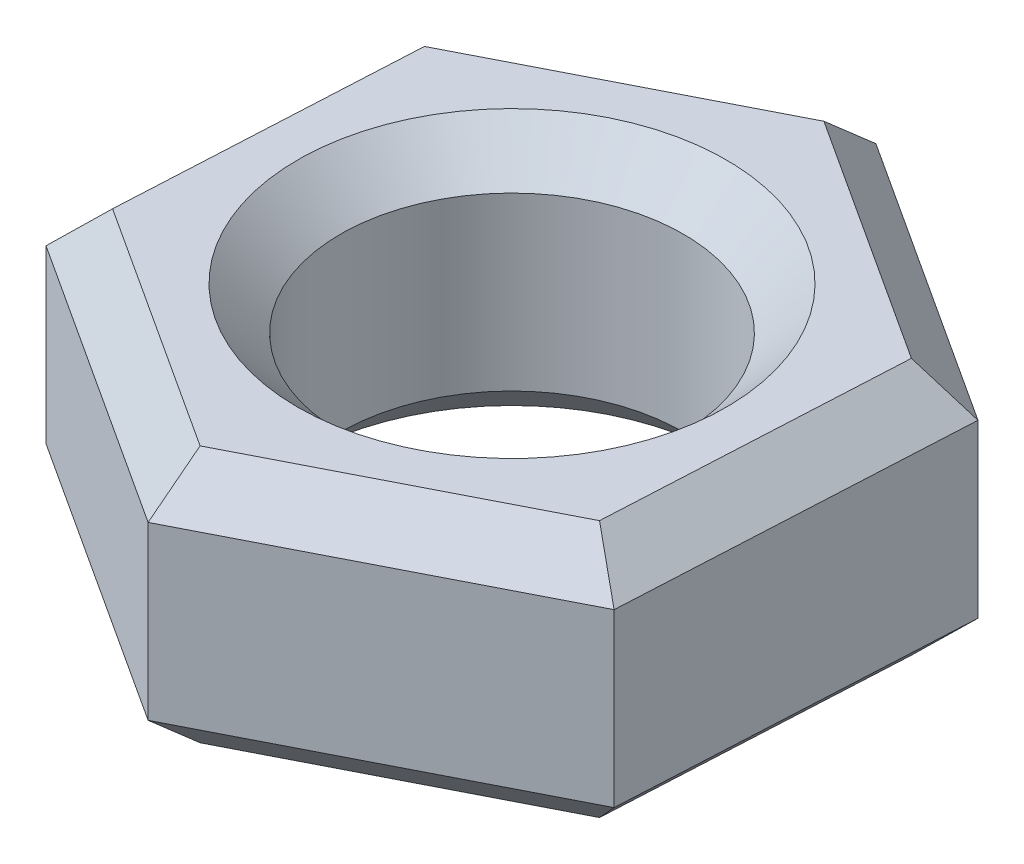
ISO-10303-21;
HEADER;
FILE_DESCRIPTION(('STEP AP214'),'2;1');
FILE_NAME('part.step','',(''),(''),'','','');
FILE_SCHEMA(('AUTOMOTIVE_DESIGN { 1 0 10303 214 1 1 1 1 }'));
ENDSEC;
DATA;
#1=APPLICATION_CONTEXT('core data for automotive mechanical design processes');
#2=APPLICATION_PROTOCOL_DEFINITION('international standard','automotive_design',2000,#1);
#3=PRODUCT_CONTEXT('',#1,'mechanical');
#4=PRODUCT('Part','Part','',(#3));
#5=PRODUCT_RELATED_PRODUCT_CATEGORY('part','',(#4));
#6=PRODUCT_DEFINITION_FORMATION('','',#4);
#7=PRODUCT_DEFINITION_CONTEXT('part definition',#1,'design');
#8=PRODUCT_DEFINITION('design','',#6,#7);
#9=PRODUCT_DEFINITION_SHAPE('','',#8);
#10=(LENGTH_UNIT() NAMED_UNIT(*) SI_UNIT(.MILLI.,.METRE.));
#11=(NAMED_UNIT(*) PLANE_ANGLE_UNIT() SI_UNIT($,.RADIAN.));
#12=(NAMED_UNIT(*) SI_UNIT($,.STERADIAN.) SOLID_ANGLE_UNIT());
#13=UNCERTAINTY_MEASURE_WITH_UNIT(LENGTH_MEASURE(1.E-05),#10,'distance_accuracy_value','');
#14=(GEOMETRIC_REPRESENTATION_CONTEXT(3) GLOBAL_UNCERTAINTY_ASSIGNED_CONTEXT((#13)) GLOBAL_UNIT_ASSIGNED_CONTEXT((#10,
#11,#12)) REPRESENTATION_CONTEXT('',''));
#15=CARTESIAN_POINT('',(0.,0.,0.));
#16=DIRECTION('',(0.,0.,1.));
#17=DIRECTION('',(1.,0.,0.));
#18=AXIS2_PLACEMENT_3D('',#15,#16,#17);
#19=CARTESIAN_POINT('',(0.,6.,0.));
#20=DIRECTION('',(0.,1.,0.));
#21=DIRECTION('',(0.,0.,1.));
#22=AXIS2_PLACEMENT_3D('',#19,#20,#21);
#23=PLANE('',#22);
#24=CARTESIAN_POINT('',(0.,6.,0.));
#25=DIRECTION('',(0.,1.,0.));
#26=DIRECTION('',(0.,0.,1.));
#27=AXIS2_PLACEMENT_3D('',#24,#25,#26);
#28=CIRCLE('',#27,5.);
#29=CARTESIAN_POINT('',(0.,6.,5.));
#30=VERTEX_POINT('',#29);
#31=EDGE_CURVE('E11',#30,#30,#28,.F.);
#32=ORIENTED_EDGE('',*,*,#31,.T.);
#33=EDGE_LOOP('',(#32));
#34=FACE_BOUND('',#33,.T.);
#35=DIRECTION('',(-0.0518026780154427,0.,0.998657339907152));
#36=VECTOR('',#35,1.);
#37=CARTESIAN_POINT('',(-6.20130207012162,6.,3.72520952007247));
#38=LINE('',#37,#36);
#39=CARTESIAN_POINT('',(-5.81249429886115,6.,-3.77026657223419));
#40=VERTEX_POINT('',#39);
#41=CARTESIAN_POINT('',(-6.17139378002466,6.,3.14863443604888));
#42=VERTEX_POINT('',#41);
#43=EDGE_CURVE('E50',#40,#42,#38,.T.);
#44=ORIENTED_EDGE('',*,*,#43,.T.);
#45=DIRECTION('',(0.838961287027663,0.,0.544191105099015));
#46=VECTOR('',#45,1.);
#47=CARTESIAN_POINT('',(0.125475043741586,6.,7.23308988930259));
#48=LINE('',#47,#46);
#49=CARTESIAN_POINT('',(-0.358899481163513,6.,6.91890100828307));
#50=VERTEX_POINT('',#49);
#51=EDGE_CURVE('E42',#42,#50,#48,.T.);
#52=ORIENTED_EDGE('',*,*,#51,.T.);
#53=DIRECTION('',(0.890763965043106,0.,-0.454466234808137));
#54=VECTOR('',#53,1.);
#55=CARTESIAN_POINT('',(6.32677711386321,6.,3.50788036923011));
#56=LINE('',#55,#54);
#57=CARTESIAN_POINT('',(5.81249429886115,6.,3.77026657223419));
#58=VERTEX_POINT('',#57);
#59=EDGE_CURVE('E189',#50,#58,#56,.T.);
#60=ORIENTED_EDGE('',*,*,#59,.T.);
#61=DIRECTION('',(0.0518026780154426,0.,-0.998657339907152));
#62=VECTOR('',#61,1.);
#63=CARTESIAN_POINT('',(6.20130207012162,6.,-3.72520952007247));
#64=LINE('',#63,#62);
#65=CARTESIAN_POINT('',(6.17139378002466,6.,-3.14863443604888));
#66=VERTEX_POINT('',#65);
#67=EDGE_CURVE('E191',#58,#66,#64,.T.);
#68=ORIENTED_EDGE('',*,*,#67,.T.);
#69=DIRECTION('',(-0.838961287027663,0.,-0.544191105099015));
#70=VECTOR('',#69,1.);
#71=CARTESIAN_POINT('',(-0.125475043741586,6.,-7.23308988930259));
#72=LINE('',#71,#70);
#73=CARTESIAN_POINT('',(0.358899481163513,6.,-6.91890100828307));
#74=VERTEX_POINT('',#73);
#75=EDGE_CURVE('E193',#66,#74,#72,.T.);
#76=ORIENTED_EDGE('',*,*,#75,.T.);
#77=DIRECTION('',(-0.890763965043106,0.,0.454466234808137));
#78=VECTOR('',#77,1.);
#79=CARTESIAN_POINT('',(-6.32677711386321,6.,-3.50788036923012));
#80=LINE('',#79,#78);
#81=EDGE_CURVE('E55',#74,#40,#80,.T.);
#82=ORIENTED_EDGE('',*,*,#81,.T.);
#83=EDGE_LOOP('',(#44,#52,#60,#68,#76,#82));
#84=FACE_BOUND('',#83,.T.);
#85=ADVANCED_FACE('F33',(#34,#84),#23,.T.);
#86=CARTESIAN_POINT('',(0.,0.,0.));
#87=DIRECTION('',(0.,1.,0.));
#88=DIRECTION('',(0.,0.,1.));
#89=AXIS2_PLACEMENT_3D('',#86,#87,#88);
#90=PLANE('',#89);
#91=CARTESIAN_POINT('',(0.,0.,0.));
#92=DIRECTION('',(0.,1.,0.));
#93=DIRECTION('',(0.,0.,1.));
#94=AXIS2_PLACEMENT_3D('',#91,#92,#93);
#95=CIRCLE('',#94,5.);
#96=CARTESIAN_POINT('',(0.,0.,5.));
#97=VERTEX_POINT('',#96);
#98=EDGE_CURVE('E151',#97,#97,#95,.T.);
#99=ORIENTED_EDGE('',*,*,#98,.T.);
#100=EDGE_LOOP('',(#99));
#101=FACE_BOUND('',#100,.T.);
#102=DIRECTION('',(0.838961287027663,0.,0.544191105099015));
#103=VECTOR('',#102,1.);
#104=CARTESIAN_POINT('',(3.26514663059409,0.,-5.03376772216598));
#105=LINE('',#104,#103);
#106=CARTESIAN_POINT('',(0.358899481163514,0.,-6.91890100828307));
#107=VERTEX_POINT('',#106);
#108=CARTESIAN_POINT('',(6.17139378002466,0.,-3.14863443604888));
#109=VERTEX_POINT('',#108);
#110=EDGE_CURVE('E150',#107,#109,#105,.T.);
#111=ORIENTED_EDGE('',*,*,#110,.T.);
#112=DIRECTION('',(-0.0518026780154426,0.,0.998657339907152));
#113=VECTOR('',#112,1.);
#114=CARTESIAN_POINT('',(5.99194403944291,0.,0.310816068092655));
#115=LINE('',#114,#113);
#116=CARTESIAN_POINT('',(5.81249429886115,0.,3.77026657223419));
#117=VERTEX_POINT('',#116);
#118=EDGE_CURVE('E129',#109,#117,#115,.T.);
#119=ORIENTED_EDGE('',*,*,#118,.T.);
#120=DIRECTION('',(-0.890763965043106,0.,0.454466234808137));
#121=VECTOR('',#120,1.);
#122=CARTESIAN_POINT('',(2.72679740884882,0.,5.34458379025863));
#123=LINE('',#122,#121);
#124=CARTESIAN_POINT('',(-0.358899481163513,0.,6.91890100828307));
#125=VERTEX_POINT('',#124);
#126=EDGE_CURVE('E139',#117,#125,#123,.T.);
#127=ORIENTED_EDGE('',*,*,#126,.T.);
#128=DIRECTION('',(-0.838961287027663,0.,-0.544191105099015));
#129=VECTOR('',#128,1.);
#130=CARTESIAN_POINT('',(-3.26514663059409,0.,5.03376772216597));
#131=LINE('',#130,#129);
#132=CARTESIAN_POINT('',(-6.17139378002466,0.,3.14863443604888));
#133=VERTEX_POINT('',#132);
#134=EDGE_CURVE('E145',#125,#133,#131,.T.);
#135=ORIENTED_EDGE('',*,*,#134,.T.);
#136=DIRECTION('',(0.0518026780154427,0.,-0.998657339907152));
#137=VECTOR('',#136,1.);
#138=CARTESIAN_POINT('',(-5.9919440394429,0.,-0.310816068092656));
#139=LINE('',#138,#137);
#140=CARTESIAN_POINT('',(-5.81249429886115,0.,-3.77026657223419));
#141=VERTEX_POINT('',#140);
#142=EDGE_CURVE('E251',#133,#141,#139,.T.);
#143=ORIENTED_EDGE('',*,*,#142,.T.);
#144=DIRECTION('',(0.890763965043106,0.,-0.454466234808137));
#145=VECTOR('',#144,1.);
#146=CARTESIAN_POINT('',(-2.72679740884882,0.,-5.34458379025863));
#147=LINE('',#146,#145);
#148=EDGE_CURVE('E156',#141,#107,#147,.T.);
#149=ORIENTED_EDGE('',*,*,#148,.T.);
#150=EDGE_LOOP('',(#111,#119,#127,#135,#143,#149));
#151=FACE_BOUND('',#150,.T.);
#152=ADVANCED_FACE('F148',(#101,#151),#90,.F.);
#153=CARTESIAN_POINT('',(-0.418716061357431,6.,8.07205117633025));
#154=DIRECTION('',(-0.454466234808137,0.,-0.890763965043106));
#155=DIRECTION('',(-0.890763965043106,0.,0.454466234808137));
#156=AXIS2_PLACEMENT_3D('',#153,#154,#155);
#157=PLANE('',#156);
#158=DIRECTION('',(0.,-1.,0.));
#159=VECTOR('',#158,1.);
#160=CARTESIAN_POINT('',(-0.418716061357431,6.,8.07205117633025));
#161=LINE('',#160,#159);
#162=CARTESIAN_POINT('',(-0.418716061357431,4.99999999999999,8.07205117633025));
#163=VERTEX_POINT('',#162);
#164=CARTESIAN_POINT('',(-0.418716061357431,1.,8.07205117633025));
#165=VERTEX_POINT('',#164);
#166=EDGE_CURVE('E208',#163,#165,#161,.T.);
#167=ORIENTED_EDGE('',*,*,#166,.T.);
#168=DIRECTION('',(0.890763965043106,0.,-0.454466234808137));
#169=VECTOR('',#168,1.);
#170=CARTESIAN_POINT('',(-0.418716061357431,1.,8.07205117633025));
#171=LINE('',#170,#169);
#172=CARTESIAN_POINT('',(6.78124334867135,1.,4.39864433427322));
#173=VERTEX_POINT('',#172);
#174=EDGE_CURVE('E187',#165,#173,#171,.T.);
#175=ORIENTED_EDGE('',*,*,#174,.T.);
#176=DIRECTION('',(0.,-1.,0.));
#177=VECTOR('',#176,1.);
#178=CARTESIAN_POINT('',(6.78124334867135,6.,4.39864433427322));
#179=LINE('',#178,#177);
#180=CARTESIAN_POINT('',(6.78124334867135,4.99999999999999,4.39864433427322));
#181=VERTEX_POINT('',#180);
#182=EDGE_CURVE('E146',#181,#173,#179,.T.);
#183=ORIENTED_EDGE('',*,*,#182,.F.);
#184=DIRECTION('',(-0.890763965043106,0.,0.454466234808137));
#185=VECTOR('',#184,1.);
#186=CARTESIAN_POINT('',(-0.418716061357431,4.99999999999999,8.07205117633025));
#187=LINE('',#186,#185);
#188=EDGE_CURVE('E185',#181,#163,#187,.T.);
#189=ORIENTED_EDGE('',*,*,#188,.T.);
#190=EDGE_LOOP('',(#167,#175,#183,#189));
#191=FACE_BOUND('',#190,.T.);
#192=ADVANCED_FACE('F275',(#191),#157,.F.);
#193=CARTESIAN_POINT('',(6.78124334867135,6.,4.39864433427322));
#194=DIRECTION('',(-0.998657339907152,0.,-0.0518026780154426));
#195=DIRECTION('',(-0.0518026780154426,0.,0.998657339907152));
#196=AXIS2_PLACEMENT_3D('',#193,#194,#195);
#197=PLANE('',#196);
#198=ORIENTED_EDGE('',*,*,#182,.T.);
#199=DIRECTION('',(0.0518026780154426,0.,-0.998657339907152));
#200=VECTOR('',#199,1.);
#201=CARTESIAN_POINT('',(6.78124334867135,1.,4.39864433427322));
#202=LINE('',#201,#200);
#203=CARTESIAN_POINT('',(7.19995941002878,1.,-3.67340684205703));
#204=VERTEX_POINT('',#203);
#205=EDGE_CURVE('E132',#173,#204,#202,.T.);
#206=ORIENTED_EDGE('',*,*,#205,.T.);
#207=DIRECTION('',(0.,-1.,0.));
#208=VECTOR('',#207,1.);
#209=CARTESIAN_POINT('',(7.19995941002878,6.,-3.67340684205703));
#210=LINE('',#209,#208);
#211=CARTESIAN_POINT('',(7.19995941002878,4.99999999999999,-3.67340684205703));
#212=VERTEX_POINT('',#211);
#213=EDGE_CURVE('E237',#212,#204,#210,.T.);
#214=ORIENTED_EDGE('',*,*,#213,.F.);
#215=DIRECTION('',(-0.0518026780154426,0.,0.998657339907152));
#216=VECTOR('',#215,1.);
#217=CARTESIAN_POINT('',(6.78124334867135,4.99999999999999,4.39864433427322));
#218=LINE('',#217,#216);
#219=EDGE_CURVE('E165',#212,#181,#218,.T.);
#220=ORIENTED_EDGE('',*,*,#219,.T.);
#221=EDGE_LOOP('',(#198,#206,#214,#220));
#222=FACE_BOUND('',#221,.T.);
#223=ADVANCED_FACE('F242',(#222),#197,.F.);
#224=CARTESIAN_POINT('',(7.19995941002878,6.,-3.67340684205703));
#225=DIRECTION('',(-0.544191105099015,0.,0.838961287027663));
#226=DIRECTION('',(0.838961287027663,0.,0.544191105099015));
#227=AXIS2_PLACEMENT_3D('',#224,#225,#226);
#228=PLANE('',#227);
#229=ORIENTED_EDGE('',*,*,#213,.T.);
#230=DIRECTION('',(-0.838961287027663,0.,-0.544191105099015));
#231=VECTOR('',#230,1.);
#232=CARTESIAN_POINT('',(7.19995941002878,1.,-3.67340684205703));
#233=LINE('',#232,#231);
#234=CARTESIAN_POINT('',(0.418716061357432,1.,-8.07205117633026));
#235=VERTEX_POINT('',#234);
#236=EDGE_CURVE('E170',#204,#235,#233,.T.);
#237=ORIENTED_EDGE('',*,*,#236,.T.);
#238=DIRECTION('',(0.,-1.,0.));
#239=VECTOR('',#238,1.);
#240=CARTESIAN_POINT('',(0.418716061357432,6.,-8.07205117633026));
#241=LINE('',#240,#239);
#242=CARTESIAN_POINT('',(0.418716061357432,4.99999999999999,-8.07205117633026));
#243=VERTEX_POINT('',#242);
#244=EDGE_CURVE('E239',#243,#235,#241,.T.);
#245=ORIENTED_EDGE('',*,*,#244,.F.);
#246=DIRECTION('',(0.838961287027663,0.,0.544191105099015));
#247=VECTOR('',#246,1.);
#248=CARTESIAN_POINT('',(7.19995941002878,4.99999999999999,-3.67340684205703));
#249=LINE('',#248,#247);
#250=EDGE_CURVE('E168',#243,#212,#249,.T.);
#251=ORIENTED_EDGE('',*,*,#250,.T.);
#252=EDGE_LOOP('',(#229,#237,#245,#251));
#253=FACE_BOUND('',#252,.T.);
#254=ADVANCED_FACE('F236',(#253),#228,.F.);
#255=CARTESIAN_POINT('',(0.418716061357432,6.,-8.07205117633026));
#256=DIRECTION('',(0.454466234808137,0.,0.890763965043106));
#257=DIRECTION('',(0.890763965043106,0.,-0.454466234808137));
#258=AXIS2_PLACEMENT_3D('',#255,#256,#257);
#259=PLANE('',#258);
#260=ORIENTED_EDGE('',*,*,#244,.T.);
#261=DIRECTION('',(-0.890763965043106,0.,0.454466234808137));
#262=VECTOR('',#261,1.);
#263=CARTESIAN_POINT('',(0.418716061357432,1.,-8.07205117633026));
#264=LINE('',#263,#262);
#265=CARTESIAN_POINT('',(-6.78124334867135,1.,-4.39864433427323));
#266=VERTEX_POINT('',#265);
#267=EDGE_CURVE('E174',#235,#266,#264,.T.);
#268=ORIENTED_EDGE('',*,*,#267,.T.);
#269=DIRECTION('',(0.,-1.,0.));
#270=VECTOR('',#269,1.);
#271=CARTESIAN_POINT('',(-6.78124334867135,6.,-4.39864433427323));
#272=LINE('',#271,#270);
#273=CARTESIAN_POINT('',(-6.78124334867135,4.99999999999999,-4.39864433427323));
#274=VERTEX_POINT('',#273);
#275=EDGE_CURVE('E246',#274,#266,#272,.T.);
#276=ORIENTED_EDGE('',*,*,#275,.F.);
#277=DIRECTION('',(0.890763965043106,0.,-0.454466234808137));
#278=VECTOR('',#277,1.);
#279=CARTESIAN_POINT('',(0.418716061357432,4.99999999999999,-8.07205117633026));
#280=LINE('',#279,#278);
#281=EDGE_CURVE('E172',#274,#243,#280,.T.);
#282=ORIENTED_EDGE('',*,*,#281,.T.);
#283=EDGE_LOOP('',(#260,#268,#276,#282));
#284=FACE_BOUND('',#283,.T.);
#285=ADVANCED_FACE('F263',(#284),#259,.F.);
#286=CARTESIAN_POINT('',(-6.78124334867135,6.,-4.39864433427323));
#287=DIRECTION('',(0.998657339907152,0.,0.0518026780154427));
#288=DIRECTION('',(0.0518026780154427,0.,-0.998657339907152));
#289=AXIS2_PLACEMENT_3D('',#286,#287,#288);
#290=PLANE('',#289);
#291=ORIENTED_EDGE('',*,*,#275,.T.);
#292=DIRECTION('',(-0.0518026780154427,0.,0.998657339907152));
#293=VECTOR('',#292,1.);
#294=CARTESIAN_POINT('',(-6.78124334867135,1.,-4.39864433427323));
#295=LINE('',#294,#293);
#296=CARTESIAN_POINT('',(-7.19995941002878,1.,3.67340684205702));
#297=VERTEX_POINT('',#296);
#298=EDGE_CURVE('E178',#266,#297,#295,.T.);
#299=ORIENTED_EDGE('',*,*,#298,.T.);
#300=DIRECTION('',(0.,-1.,0.));
#301=VECTOR('',#300,1.);
#302=CARTESIAN_POINT('',(-7.19995941002878,6.,3.67340684205702));
#303=LINE('',#302,#301);
#304=CARTESIAN_POINT('',(-7.19995941002878,4.99999999999999,3.67340684205702));
#305=VERTEX_POINT('',#304);
#306=EDGE_CURVE('E268',#305,#297,#303,.T.);
#307=ORIENTED_EDGE('',*,*,#306,.F.);
#308=DIRECTION('',(0.0518026780154427,0.,-0.998657339907152));
#309=VECTOR('',#308,1.);
#310=CARTESIAN_POINT('',(-6.78124334867135,4.99999999999999,-4.39864433427323));
#311=LINE('',#310,#309);
#312=EDGE_CURVE('E176',#305,#274,#311,.T.);
#313=ORIENTED_EDGE('',*,*,#312,.T.);
#314=EDGE_LOOP('',(#291,#299,#307,#313));
#315=FACE_BOUND('',#314,.T.);
#316=ADVANCED_FACE('F286',(#315),#290,.F.);
#317=CARTESIAN_POINT('',(-7.19995941002878,6.,3.67340684205702));
#318=DIRECTION('',(0.544191105099015,0.,-0.838961287027663));
#319=DIRECTION('',(-0.838961287027663,0.,-0.544191105099015));
#320=AXIS2_PLACEMENT_3D('',#317,#318,#319);
#321=PLANE('',#320);
#322=ORIENTED_EDGE('',*,*,#306,.T.);
#323=DIRECTION('',(0.838961287027663,0.,0.544191105099015));
#324=VECTOR('',#323,1.);
#325=CARTESIAN_POINT('',(-7.19995941002878,1.,3.67340684205702));
#326=LINE('',#325,#324);
#327=EDGE_CURVE('E183',#297,#165,#326,.T.);
#328=ORIENTED_EDGE('',*,*,#327,.T.);
#329=ORIENTED_EDGE('',*,*,#166,.F.);
#330=DIRECTION('',(-0.838961287027663,0.,-0.544191105099015));
#331=VECTOR('',#330,1.);
#332=CARTESIAN_POINT('',(-7.19995941002878,4.99999999999999,3.67340684205702));
#333=LINE('',#332,#331);
#334=EDGE_CURVE('E180',#163,#305,#333,.T.);
#335=ORIENTED_EDGE('',*,*,#334,.T.);
#336=EDGE_LOOP('',(#322,#328,#329,#335));
#337=FACE_BOUND('',#336,.T.);
#338=ADVANCED_FACE('F287',(#337),#321,.F.);
#339=CARTESIAN_POINT('',(0.,6.,0.));
#340=DIRECTION('',(0.,-1.,0.));
#341=DIRECTION('',(0.,0.,-1.));
#342=AXIS2_PLACEMENT_3D('',#339,#340,#341);
#343=CYLINDRICAL_SURFACE('',#342,4.);
#344=CARTESIAN_POINT('',(0.,1.00000000000001,0.));
#345=DIRECTION('',(0.,1.,0.));
#346=DIRECTION('',(0.,0.,1.));
#347=AXIS2_PLACEMENT_3D('',#344,#345,#346);
#348=CIRCLE('',#347,4.);
#349=CARTESIAN_POINT('',(0.,1.00000000000001,4.));
#350=VERTEX_POINT('',#349);
#351=EDGE_CURVE('E162',#350,#350,#348,.F.);
#352=ORIENTED_EDGE('',*,*,#351,.T.);
#353=EDGE_LOOP('',(#352));
#354=FACE_BOUND('',#353,.T.);
#355=CARTESIAN_POINT('',(0.,5.,0.));
#356=DIRECTION('',(0.,1.,0.));
#357=DIRECTION('',(0.,0.,1.));
#358=AXIS2_PLACEMENT_3D('',#355,#356,#357);
#359=CIRCLE('',#358,4.);
#360=CARTESIAN_POINT('',(0.,5.,4.));
#361=VERTEX_POINT('',#360);
#362=EDGE_CURVE('E154',#361,#361,#359,.T.);
#363=ORIENTED_EDGE('',*,*,#362,.T.);
#364=EDGE_LOOP('',(#363));
#365=FACE_BOUND('',#364,.T.);
#366=ADVANCED_FACE('F306',(#354,#365),#343,.F.);
#367=CARTESIAN_POINT('',(0.,0.,0.));
#368=DIRECTION('',(0.,-1.,0.));
#369=DIRECTION('',(0.,0.,-1.));
#370=AXIS2_PLACEMENT_3D('',#367,#368,#369);
#371=CONICAL_SURFACE('',#370,5.,0.785398163397447);
#372=ORIENTED_EDGE('',*,*,#351,.F.);
#373=EDGE_LOOP('',(#372));
#374=FACE_BOUND('',#373,.T.);
#375=ORIENTED_EDGE('',*,*,#98,.F.);
#376=EDGE_LOOP('',(#375));
#377=FACE_BOUND('',#376,.T.);
#378=ADVANCED_FACE('F320',(#374,#377),#371,.F.);
#379=CARTESIAN_POINT('',(-6.78124334867135,1.,-4.39864433427323));
#380=DIRECTION('',(0.706157377130065,0.707106781186549,0.0366300249083428));
#381=DIRECTION('',(-0.0518026780154427,0.,0.998657339907152));
#382=AXIS2_PLACEMENT_3D('',#379,#380,#381);
#383=PLANE('',#382);
#384=DIRECTION('',(0.634195121453109,-0.654653670707976,0.411369808510117));
#385=VECTOR('',#384,1.);
#386=CARTESIAN_POINT('',(-6.78124334867135,1.,-4.39864433427323));
#387=LINE('',#386,#385);
#388=EDGE_CURVE('E202',#141,#266,#387,.F.);
#389=ORIENTED_EDGE('',*,*,#388,.F.);
#390=ORIENTED_EDGE('',*,*,#142,.F.);
#391=DIRECTION('',(0.673354265246256,-0.654653670707976,-0.343544181879489));
#392=VECTOR('',#391,1.);
#393=CARTESIAN_POINT('',(-7.19995941002878,1.,3.67340684205702));
#394=LINE('',#393,#392);
#395=EDGE_CURVE('E205',#297,#133,#394,.T.);
#396=ORIENTED_EDGE('',*,*,#395,.F.);
#397=ORIENTED_EDGE('',*,*,#298,.F.);
#398=EDGE_LOOP('',(#389,#390,#396,#397));
#399=FACE_BOUND('',#398,.T.);
#400=ADVANCED_FACE('F284',(#399),#383,.F.);
#401=CARTESIAN_POINT('',(-7.19995941002878,1.,3.67340684205702));
#402=DIRECTION('',(0.384801220676914,0.707106781186548,-0.593235215210253));
#403=DIRECTION('',(0.838961287027663,0.,0.544191105099015));
#404=AXIS2_PLACEMENT_3D('',#401,#402,#403);
#405=PLANE('',#404);
#406=ORIENTED_EDGE('',*,*,#395,.T.);
#407=ORIENTED_EDGE('',*,*,#134,.F.);
#408=DIRECTION('',(0.0391591437931464,-0.654653670707976,-0.754913990389607));
#409=VECTOR('',#408,1.);
#410=CARTESIAN_POINT('',(-0.41871606135743,1.,8.07205117633025));
#411=LINE('',#410,#409);
#412=EDGE_CURVE('E142',#165,#125,#411,.T.);
#413=ORIENTED_EDGE('',*,*,#412,.F.);
#414=ORIENTED_EDGE('',*,*,#327,.F.);
#415=EDGE_LOOP('',(#406,#407,#413,#414));
#416=FACE_BOUND('',#415,.T.);
#417=ADVANCED_FACE('F281',(#416),#405,.F.);
#418=CARTESIAN_POINT('',(0.418716061357432,1.,-8.07205117633026));
#419=DIRECTION('',(0.321356156453151,0.707106781186549,0.629865240118596));
#420=DIRECTION('',(-0.890763965043106,0.,0.454466234808137));
#421=AXIS2_PLACEMENT_3D('',#418,#419,#420);
#422=PLANE('',#421);
#423=ORIENTED_EDGE('',*,*,#388,.T.);
#424=ORIENTED_EDGE('',*,*,#267,.F.);
#425=DIRECTION('',(-0.039159143793146,-0.654653670707976,0.754913990389608));
#426=VECTOR('',#425,1.);
#427=CARTESIAN_POINT('',(0.418716061357431,1.,-8.07205117633026));
#428=LINE('',#427,#426);
#429=EDGE_CURVE('E135',#107,#235,#428,.F.);
#430=ORIENTED_EDGE('',*,*,#429,.F.);
#431=ORIENTED_EDGE('',*,*,#148,.F.);
#432=EDGE_LOOP('',(#423,#424,#430,#431));
#433=FACE_BOUND('',#432,.T.);
#434=ADVANCED_FACE('F258',(#433),#422,.F.);
#435=CARTESIAN_POINT('',(-0.418716061357431,1.,8.07205117633025));
#436=DIRECTION('',(-0.321356156453151,0.707106781186548,-0.629865240118596));
#437=DIRECTION('',(0.890763965043106,0.,-0.454466234808137));
#438=AXIS2_PLACEMENT_3D('',#435,#436,#437);
#439=PLANE('',#438);
#440=ORIENTED_EDGE('',*,*,#412,.T.);
#441=ORIENTED_EDGE('',*,*,#126,.F.);
#442=DIRECTION('',(0.634195121453108,0.654653670707976,0.411369808510117));
#443=VECTOR('',#442,1.);
#444=CARTESIAN_POINT('',(4.84374524905096,-0.999999999999998,3.14188881019516));
#445=LINE('',#444,#443);
#446=EDGE_CURVE('E125',#173,#117,#445,.F.);
#447=ORIENTED_EDGE('',*,*,#446,.F.);
#448=ORIENTED_EDGE('',*,*,#174,.F.);
#449=EDGE_LOOP('',(#440,#441,#447,#448));
#450=FACE_BOUND('',#449,.T.);
#451=ADVANCED_FACE('F140',(#450),#439,.F.);
#452=CARTESIAN_POINT('',(7.19995941002878,1.,-3.67340684205703));
#453=DIRECTION('',(-0.384801220676914,0.707106781186548,0.593235215210253));
#454=DIRECTION('',(-0.838961287027663,0.,-0.544191105099015));
#455=AXIS2_PLACEMENT_3D('',#452,#453,#454);
#456=PLANE('',#455);
#457=ORIENTED_EDGE('',*,*,#429,.T.);
#458=ORIENTED_EDGE('',*,*,#236,.F.);
#459=DIRECTION('',(-0.673354265246255,-0.654653670707976,0.343544181879491));
#460=VECTOR('',#459,1.);
#461=CARTESIAN_POINT('',(7.19995941002878,1.,-3.67340684205703));
#462=LINE('',#461,#460);
#463=EDGE_CURVE('E136',#109,#204,#462,.F.);
#464=ORIENTED_EDGE('',*,*,#463,.F.);
#465=ORIENTED_EDGE('',*,*,#110,.F.);
#466=EDGE_LOOP('',(#457,#458,#464,#465));
#467=FACE_BOUND('',#466,.T.);
#468=ADVANCED_FACE('F261',(#467),#456,.F.);
#469=CARTESIAN_POINT('',(6.78124334867135,1.,4.39864433427322));
#470=DIRECTION('',(-0.706157377130065,0.707106781186548,-0.0366300249083427));
#471=DIRECTION('',(0.0518026780154426,0.,-0.998657339907152));
#472=AXIS2_PLACEMENT_3D('',#469,#470,#471);
#473=PLANE('',#472);
#474=ORIENTED_EDGE('',*,*,#446,.T.);
#475=ORIENTED_EDGE('',*,*,#118,.F.);
#476=ORIENTED_EDGE('',*,*,#463,.T.);
#477=ORIENTED_EDGE('',*,*,#205,.F.);
#478=EDGE_LOOP('',(#474,#475,#476,#477));
#479=FACE_BOUND('',#478,.T.);
#480=ADVANCED_FACE('F127',(#479),#473,.F.);
#481=CARTESIAN_POINT('',(0.,5.,0.));
#482=DIRECTION('',(0.,1.,0.));
#483=DIRECTION('',(0.,0.,1.));
#484=AXIS2_PLACEMENT_3D('',#481,#482,#483);
#485=CONICAL_SURFACE('',#484,4.,0.785398163397448);
#486=ORIENTED_EDGE('',*,*,#31,.F.);
#487=EDGE_LOOP('',(#486));
#488=FACE_BOUND('',#487,.T.);
#489=ORIENTED_EDGE('',*,*,#362,.F.);
#490=EDGE_LOOP('',(#489));
#491=FACE_BOUND('',#490,.T.);
#492=ADVANCED_FACE('F326',(#488,#491),#485,.F.);
#493=CARTESIAN_POINT('',(3.26514663059409,6.,-5.03376772216598));
#494=DIRECTION('',(0.384801220676916,0.707106781186546,-0.593235215210255));
#495=DIRECTION('',(0.838961287027663,0.,0.544191105099015));
#496=AXIS2_PLACEMENT_3D('',#493,#494,#495);
#497=PLANE('',#496);
#498=DIRECTION('',(-0.673354265246253,0.654653670707979,0.34354418187949));
#499=VECTOR('',#498,1.);
#500=CARTESIAN_POINT('',(5.289766097164,6.85714285714286,-2.69882951661333));
#501=LINE('',#500,#499);
#502=EDGE_CURVE('E218',#212,#66,#501,.T.);
#503=ORIENTED_EDGE('',*,*,#502,.F.);
#504=ORIENTED_EDGE('',*,*,#250,.F.);
#505=DIRECTION('',(-0.039159143793146,0.654653670707979,0.754913990389605));
#506=VECTOR('',#505,1.);
#507=CARTESIAN_POINT('',(0.307628126711584,6.85714285714286,-5.93048657852835));
#508=LINE('',#507,#506);
#509=EDGE_CURVE('E37',#74,#243,#508,.F.);
#510=ORIENTED_EDGE('',*,*,#509,.F.);
#511=ORIENTED_EDGE('',*,*,#75,.F.);
#512=EDGE_LOOP('',(#503,#504,#510,#511));
#513=FACE_BOUND('',#512,.T.);
#514=ADVANCED_FACE('F35',(#513),#497,.T.);
#515=CARTESIAN_POINT('',(-2.72679740884882,6.,-5.34458379025863));
#516=DIRECTION('',(-0.321356156453152,0.707106781186546,-0.629865240118598));
#517=DIRECTION('',(0.890763965043106,0.,-0.454466234808137));
#518=AXIS2_PLACEMENT_3D('',#515,#516,#517);
#519=PLANE('',#518);
#520=ORIENTED_EDGE('',*,*,#509,.T.);
#521=ORIENTED_EDGE('',*,*,#281,.F.);
#522=DIRECTION('',(0.634195121453107,0.654653670707978,0.411369808510116));
#523=VECTOR('',#522,1.);
#524=CARTESIAN_POINT('',(-4.98213797045242,6.85714285714286,-3.23165706191503));
#525=LINE('',#524,#523);
#526=EDGE_CURVE('E216',#40,#274,#525,.F.);
#527=ORIENTED_EDGE('',*,*,#526,.F.);
#528=ORIENTED_EDGE('',*,*,#81,.F.);
#529=EDGE_LOOP('',(#520,#521,#527,#528));
#530=FACE_BOUND('',#529,.T.);
#531=ADVANCED_FACE('F228',(#530),#519,.T.);
#532=CARTESIAN_POINT('',(5.99194403944291,6.,0.310816068092655));
#533=DIRECTION('',(0.706157377130068,0.707106781186546,0.0366300249083428));
#534=DIRECTION('',(-0.0518026780154426,0.,0.998657339907152));
#535=AXIS2_PLACEMENT_3D('',#532,#533,#534);
#536=PLANE('',#535);
#537=ORIENTED_EDGE('',*,*,#502,.T.);
#538=ORIENTED_EDGE('',*,*,#67,.F.);
#539=DIRECTION('',(-0.634195121453106,0.654653670707979,-0.411369808510116));
#540=VECTOR('',#539,1.);
#541=CARTESIAN_POINT('',(4.98213797045242,6.85714285714286,3.23165706191502));
#542=LINE('',#541,#540);
#543=EDGE_CURVE('E213',#181,#58,#542,.T.);
#544=ORIENTED_EDGE('',*,*,#543,.F.);
#545=ORIENTED_EDGE('',*,*,#219,.F.);
#546=EDGE_LOOP('',(#537,#538,#544,#545));
#547=FACE_BOUND('',#546,.T.);
#548=ADVANCED_FACE('F347',(#547),#536,.T.);
#549=CARTESIAN_POINT('',(-5.99194403944291,6.,-0.310816068092656));
#550=DIRECTION('',(-0.706157377130067,0.707106781186546,-0.0366300249083429));
#551=DIRECTION('',(0.0518026780154427,0.,-0.998657339907152));
#552=AXIS2_PLACEMENT_3D('',#549,#550,#551);
#553=PLANE('',#552);
#554=ORIENTED_EDGE('',*,*,#526,.T.);
#555=ORIENTED_EDGE('',*,*,#312,.F.);
#556=DIRECTION('',(0.673354265246254,0.654653670707979,-0.343544181879489));
#557=VECTOR('',#556,1.);
#558=CARTESIAN_POINT('',(-5.289766097164,6.85714285714285,2.69882951661333));
#559=LINE('',#558,#557);
#560=EDGE_CURVE('E211',#42,#305,#559,.F.);
#561=ORIENTED_EDGE('',*,*,#560,.F.);
#562=ORIENTED_EDGE('',*,*,#43,.F.);
#563=EDGE_LOOP('',(#554,#555,#561,#562));
#564=FACE_BOUND('',#563,.T.);
#565=ADVANCED_FACE('F344',(#564),#553,.T.);
#566=CARTESIAN_POINT('',(2.72679740884882,6.,5.34458379025863));
#567=DIRECTION('',(0.321356156453152,0.707106781186546,0.629865240118598));
#568=DIRECTION('',(-0.890763965043106,0.,0.454466234808137));
#569=AXIS2_PLACEMENT_3D('',#566,#567,#568);
#570=PLANE('',#569);
#571=ORIENTED_EDGE('',*,*,#543,.T.);
#572=ORIENTED_EDGE('',*,*,#59,.F.);
#573=DIRECTION('',(-0.0391591437931464,-0.654653670707979,0.754913990389605));
#574=VECTOR('',#573,1.);
#575=CARTESIAN_POINT('',(-0.307628126711583,6.85714285714286,5.93048657852835));
#576=LINE('',#575,#574);
#577=EDGE_CURVE('E209',#163,#50,#576,.F.);
#578=ORIENTED_EDGE('',*,*,#577,.F.);
#579=ORIENTED_EDGE('',*,*,#188,.F.);
#580=EDGE_LOOP('',(#571,#572,#578,#579));
#581=FACE_BOUND('',#580,.T.);
#582=ADVANCED_FACE('F295',(#581),#570,.T.);
#583=CARTESIAN_POINT('',(-3.26514663059409,6.,5.03376772216597));
#584=DIRECTION('',(-0.384801220676916,0.707106781186546,0.593235215210255));
#585=DIRECTION('',(-0.838961287027663,0.,-0.544191105099015));
#586=AXIS2_PLACEMENT_3D('',#583,#584,#585);
#587=PLANE('',#586);
#588=ORIENTED_EDGE('',*,*,#560,.T.);
#589=ORIENTED_EDGE('',*,*,#334,.F.);
#590=ORIENTED_EDGE('',*,*,#577,.T.);
#591=ORIENTED_EDGE('',*,*,#51,.F.);
#592=EDGE_LOOP('',(#588,#589,#590,#591));
#593=FACE_BOUND('',#592,.T.);
#594=ADVANCED_FACE('F290',(#593),#587,.T.);
#595=CLOSED_SHELL('',(#85,#152,#192,#223,#254,#285,#316,#338,#366,#378,#400,#417,#434,#451,#468,
#480,#492,#514,#531,#548,#565,#582,#594));
#596=MANIFOLD_SOLID_BREP('B2',#595);
#597=ADVANCED_BREP_SHAPE_REPRESENTATION('',(#18,#596),#14);
#598=SHAPE_DEFINITION_REPRESENTATION(#9,#597);
ENDSEC;
END-ISO-10303-21;
